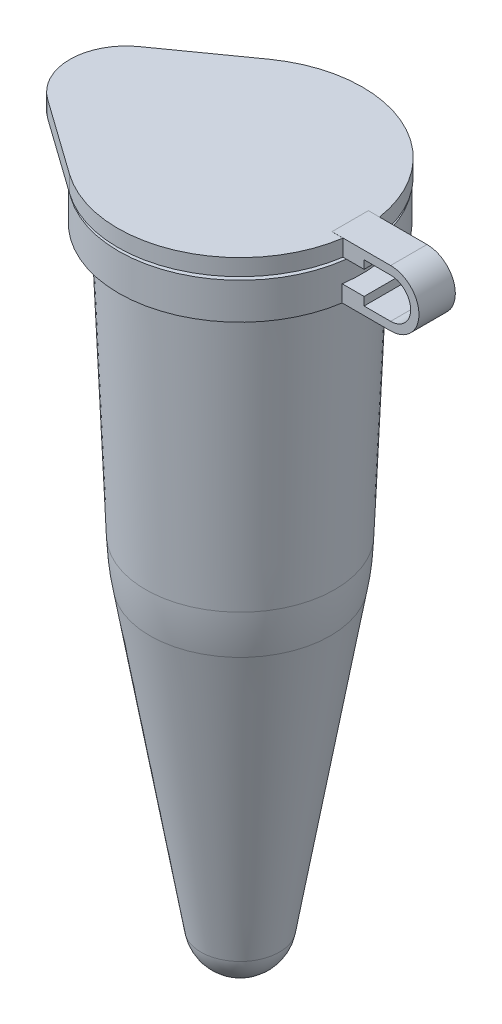
ISO-10303-21;
HEADER;
FILE_DESCRIPTION(('STEP AP214'),'2;1');
FILE_NAME('part.step','',(''),(''),'','','');
FILE_SCHEMA(('AUTOMOTIVE_DESIGN { 1 0 10303 214 1 1 1 1 }'));
ENDSEC;
DATA;
#1=APPLICATION_CONTEXT('core data for automotive mechanical design processes');
#2=APPLICATION_PROTOCOL_DEFINITION('international standard','automotive_design',2000,#1);
#3=PRODUCT_CONTEXT('',#1,'mechanical');
#4=PRODUCT('Part','Part','',(#3));
#5=PRODUCT_RELATED_PRODUCT_CATEGORY('part','',(#4));
#6=PRODUCT_DEFINITION_FORMATION('','',#4);
#7=PRODUCT_DEFINITION_CONTEXT('part definition',#1,'design');
#8=PRODUCT_DEFINITION('design','',#6,#7);
#9=PRODUCT_DEFINITION_SHAPE('','',#8);
#10=(LENGTH_UNIT() NAMED_UNIT(*) SI_UNIT(.MILLI.,.METRE.));
#11=(NAMED_UNIT(*) PLANE_ANGLE_UNIT() SI_UNIT($,.RADIAN.));
#12=(NAMED_UNIT(*) SI_UNIT($,.STERADIAN.) SOLID_ANGLE_UNIT());
#13=UNCERTAINTY_MEASURE_WITH_UNIT(LENGTH_MEASURE(1.E-05),#10,'distance_accuracy_value','');
#14=(GEOMETRIC_REPRESENTATION_CONTEXT(3) GLOBAL_UNCERTAINTY_ASSIGNED_CONTEXT((#13)) GLOBAL_UNIT_ASSIGNED_CONTEXT((#10,
#11,#12)) REPRESENTATION_CONTEXT('',''));
#15=CARTESIAN_POINT('',(0.,0.,0.));
#16=DIRECTION('',(0.,0.,1.));
#17=DIRECTION('',(1.,0.,0.));
#18=AXIS2_PLACEMENT_3D('',#15,#16,#17);
#19=CARTESIAN_POINT('',(3.37929453171218,0.112660744795347,0.5588));
#20=DIRECTION('',(0.,1.,0.));
#21=DIRECTION('',(0.,0.,1.));
#22=AXIS2_PLACEMENT_3D('',#19,#20,#21);
#23=PLANE('',#22);
#24=DIRECTION('',(1.,0.,0.));
#25=VECTOR('',#24,1.);
#26=CARTESIAN_POINT('',(3.37929453171218,0.112660744795347,0.5588));
#27=LINE('',#26,#25);
#28=CARTESIAN_POINT('',(3.71743556769986,0.112660744795347,0.5588));
#29=VERTEX_POINT('',#28);
#30=CARTESIAN_POINT('',(4.36532286100338,0.112660744795347,0.5588));
#31=VERTEX_POINT('',#30);
#32=EDGE_CURVE('E225',#29,#31,#27,.T.);
#33=ORIENTED_EDGE('',*,*,#32,.F.);
#34=CARTESIAN_POINT('',(0.,0.112660744795347,0.));
#35=DIRECTION('',(0.,-1.,0.));
#36=DIRECTION('',(0.,0.,-1.));
#37=AXIS2_PLACEMENT_3D('',#34,#35,#36);
#38=CIRCLE('',#37,3.7592);
#39=CARTESIAN_POINT('',(-2.17993527229624,0.112660744795347,3.06259152493419));
#40=VERTEX_POINT('',#39);
#41=EDGE_CURVE('E198',#29,#40,#38,.T.);
#42=ORIENTED_EDGE('',*,*,#41,.T.);
#43=DIRECTION('',(-0.814692361389175,0.,-0.579893400802363));
#44=VECTOR('',#43,1.);
#45=CARTESIAN_POINT('',(-2.17993527229624,0.112660744795347,3.06259152493419));
#46=LINE('',#45,#44);
#47=CARTESIAN_POINT('',(-4.50743423035828,0.112660744795347,1.40589097130054));
#48=VERTEX_POINT('',#47);
#49=EDGE_CURVE('E181',#40,#48,#46,.T.);
#50=ORIENTED_EDGE('',*,*,#49,.T.);
#51=CARTESIAN_POINT('',(-3.50672901309731,0.112660744795347,0.));
#52=DIRECTION('',(0.,-1.,0.));
#53=DIRECTION('',(0.,0.,-1.));
#54=AXIS2_PLACEMENT_3D('',#51,#52,#53);
#55=CIRCLE('',#54,1.72567098690269);
#56=CARTESIAN_POINT('',(-4.50743423035828,0.112660744795347,-1.40589097130054));
#57=VERTEX_POINT('',#56);
#58=EDGE_CURVE('E200',#48,#57,#55,.T.);
#59=ORIENTED_EDGE('',*,*,#58,.T.);
#60=DIRECTION('',(0.814692361389175,0.,-0.579893400802363));
#61=VECTOR('',#60,1.);
#62=CARTESIAN_POINT('',(-2.17993527229624,0.112660744795347,-3.06259152493419));
#63=LINE('',#62,#61);
#64=CARTESIAN_POINT('',(-2.17993527229624,0.112660744795347,-3.06259152493419));
#65=VERTEX_POINT('',#64);
#66=EDGE_CURVE('E174',#57,#65,#63,.T.);
#67=ORIENTED_EDGE('',*,*,#66,.T.);
#68=CARTESIAN_POINT('',(3.71743556769986,0.112660744795347,-0.5588));
#69=VERTEX_POINT('',#68);
#70=EDGE_CURVE('E52',#65,#69,#38,.T.);
#71=ORIENTED_EDGE('',*,*,#70,.T.);
#72=DIRECTION('',(1.,0.,0.));
#73=VECTOR('',#72,1.);
#74=CARTESIAN_POINT('',(3.37929453171218,0.112660744795347,-0.5588));
#75=LINE('',#74,#73);
#76=CARTESIAN_POINT('',(4.36532286100338,0.112660744795347,-0.5588));
#77=VERTEX_POINT('',#76);
#78=EDGE_CURVE('E250',#69,#77,#75,.T.);
#79=ORIENTED_EDGE('',*,*,#78,.T.);
#80=DIRECTION('',(0.,0.,-1.));
#81=VECTOR('',#80,1.);
#82=CARTESIAN_POINT('',(4.36532286100338,0.112660744795347,0.5588));
#83=LINE('',#82,#81);
#84=EDGE_CURVE('E278',#31,#77,#83,.T.);
#85=ORIENTED_EDGE('',*,*,#84,.F.);
#86=EDGE_LOOP('',(#33,#42,#50,#59,#67,#71,#79,#85));
#87=FACE_BOUND('',#86,.T.);
#88=CARTESIAN_POINT('',(0.,0.112660744795347,0.));
#89=DIRECTION('',(0.,1.,0.));
#90=DIRECTION('',(0.,0.,1.));
#91=AXIS2_PLACEMENT_3D('',#88,#89,#90);
#92=CIRCLE('',#91,2.61504629300573);
#93=CARTESIAN_POINT('',(0.,0.112660744795347,2.61504629300573));
#94=VERTEX_POINT('',#93);
#95=EDGE_CURVE('E11',#94,#94,#92,.F.);
#96=ORIENTED_EDGE('',*,*,#95,.F.);
#97=EDGE_LOOP('',(#96));
#98=FACE_BOUND('',#97,.T.);
#99=ADVANCED_FACE('F37',(#87,#98),#23,.F.);
#100=CARTESIAN_POINT('',(3.37929453171218,0.622812555298089,0.5588));
#101=DIRECTION('',(1.,0.,0.));
#102=DIRECTION('',(0.,0.,-1.));
#103=AXIS2_PLACEMENT_3D('',#100,#101,#102);
#104=PLANE('',#103);
#105=DIRECTION('',(0.,0.,-1.));
#106=VECTOR('',#105,1.);
#107=CARTESIAN_POINT('',(3.37929453171218,0.620660744795347,0.5588));
#108=LINE('',#107,#106);
#109=CARTESIAN_POINT('',(3.37929453171218,0.620660744795347,0.5588));
#110=VERTEX_POINT('',#109);
#111=CARTESIAN_POINT('',(3.37929453171218,0.620660744795347,-0.5588));
#112=VERTEX_POINT('',#111);
#113=EDGE_CURVE('E206',#110,#112,#108,.T.);
#114=ORIENTED_EDGE('',*,*,#113,.F.);
#115=DIRECTION('',(0.,-1.,0.));
#116=VECTOR('',#115,1.);
#117=CARTESIAN_POINT('',(3.37929453171218,0.622812555298089,0.5588));
#118=LINE('',#117,#116);
#119=CARTESIAN_POINT('',(3.37929453171218,0.622812555298089,0.5588));
#120=VERTEX_POINT('',#119);
#121=EDGE_CURVE('E222',#120,#110,#118,.T.);
#122=ORIENTED_EDGE('',*,*,#121,.F.);
#123=DIRECTION('',(0.,0.,-1.));
#124=VECTOR('',#123,1.);
#125=CARTESIAN_POINT('',(3.37929453171218,0.622812555298089,0.5588));
#126=LINE('',#125,#124);
#127=CARTESIAN_POINT('',(3.37929453171218,0.622812555298089,-0.5588));
#128=VERTEX_POINT('',#127);
#129=EDGE_CURVE('E281',#120,#128,#126,.T.);
#130=ORIENTED_EDGE('',*,*,#129,.T.);
#131=DIRECTION('',(0.,-1.,0.));
#132=VECTOR('',#131,1.);
#133=CARTESIAN_POINT('',(3.37929453171218,0.622812555298089,-0.5588));
#134=LINE('',#133,#132);
#135=EDGE_CURVE('E247',#128,#112,#134,.T.);
#136=ORIENTED_EDGE('',*,*,#135,.T.);
#137=EDGE_LOOP('',(#114,#122,#130,#136));
#138=FACE_BOUND('',#137,.T.);
#139=ADVANCED_FACE('F382',(#138),#104,.F.);
#140=CARTESIAN_POINT('',(0.,-1.1176,0.));
#141=DIRECTION('',(0.,1.,0.));
#142=DIRECTION('',(0.,0.,1.));
#143=AXIS2_PLACEMENT_3D('',#140,#141,#142);
#144=CYLINDRICAL_SURFACE('',#143,3.7338);
#145=CARTESIAN_POINT('',(0.,0.,0.));
#146=DIRECTION('',(0.,1.,0.));
#147=DIRECTION('',(0.,0.,1.));
#148=AXIS2_PLACEMENT_3D('',#145,#146,#147);
#149=CIRCLE('',#148,3.7338);
#150=CARTESIAN_POINT('',(0.,0.,3.7338));
#151=VERTEX_POINT('',#150);
#152=EDGE_CURVE('E322',#151,#151,#149,.T.);
#153=ORIENTED_EDGE('',*,*,#152,.F.);
#154=EDGE_LOOP('',(#153));
#155=FACE_BOUND('',#154,.T.);
#156=CARTESIAN_POINT('',(0.,-1.1176,0.));
#157=DIRECTION('',(0.,1.,0.));
#158=DIRECTION('',(0.,0.,1.));
#159=AXIS2_PLACEMENT_3D('',#156,#157,#158);
#160=CIRCLE('',#159,3.7338);
#161=CARTESIAN_POINT('',(3.69174823085216,-1.1176,-0.5588));
#162=VERTEX_POINT('',#161);
#163=CARTESIAN_POINT('',(3.69174823085216,-1.1176,0.5588));
#164=VERTEX_POINT('',#163);
#165=EDGE_CURVE('E325',#162,#164,#160,.T.);
#166=ORIENTED_EDGE('',*,*,#165,.T.);
#167=DIRECTION('',(0.,1.,0.));
#168=VECTOR('',#167,1.);
#169=CARTESIAN_POINT('',(3.69174823085216,-1.1176,0.5588));
#170=LINE('',#169,#168);
#171=CARTESIAN_POINT('',(3.69174823085216,-0.607448189497257,0.5588));
#172=VERTEX_POINT('',#171);
#173=EDGE_CURVE('E60',#164,#172,#170,.T.);
#174=ORIENTED_EDGE('',*,*,#173,.T.);
#175=CARTESIAN_POINT('',(0.,-0.607448189497257,0.));
#176=DIRECTION('',(0.,-1.,0.));
#177=DIRECTION('',(0.,0.,-1.));
#178=AXIS2_PLACEMENT_3D('',#175,#176,#177);
#179=CIRCLE('',#178,3.7338);
#180=CARTESIAN_POINT('',(3.69174823085216,-0.607448189497257,-0.5588));
#181=VERTEX_POINT('',#180);
#182=EDGE_CURVE('E327',#172,#181,#179,.F.);
#183=ORIENTED_EDGE('',*,*,#182,.T.);
#184=DIRECTION('',(0.,1.,0.));
#185=VECTOR('',#184,1.);
#186=CARTESIAN_POINT('',(3.69174823085216,-1.1176,-0.5588));
#187=LINE('',#186,#185);
#188=EDGE_CURVE('E290',#162,#181,#187,.T.);
#189=ORIENTED_EDGE('',*,*,#188,.F.);
#190=EDGE_LOOP('',(#166,#174,#183,#189));
#191=FACE_BOUND('',#190,.T.);
#192=ADVANCED_FACE('F39',(#155,#191),#144,.T.);
#193=CARTESIAN_POINT('',(0.,-1.1176,0.));
#194=DIRECTION('',(0.,1.,0.));
#195=DIRECTION('',(0.,0.,1.));
#196=AXIS2_PLACEMENT_3D('',#193,#194,#195);
#197=PLANE('',#196);
#198=ORIENTED_EDGE('',*,*,#165,.F.);
#199=DIRECTION('',(1.,0.,0.));
#200=VECTOR('',#199,1.);
#201=CARTESIAN_POINT('',(4.36532286100338,-1.1176,-0.5588));
#202=LINE('',#201,#200);
#203=CARTESIAN_POINT('',(5.18003568051449,-1.1176,-0.5588));
#204=VERTEX_POINT('',#203);
#205=EDGE_CURVE('E214',#162,#204,#202,.T.);
#206=ORIENTED_EDGE('',*,*,#205,.T.);
#207=DIRECTION('',(0.,0.,-1.));
#208=VECTOR('',#207,1.);
#209=CARTESIAN_POINT('',(5.18003568051449,-1.1176,0.5588));
#210=LINE('',#209,#208);
#211=CARTESIAN_POINT('',(5.18003568051449,-1.1176,0.5588));
#212=VERTEX_POINT('',#211);
#213=EDGE_CURVE('E287',#212,#204,#210,.T.);
#214=ORIENTED_EDGE('',*,*,#213,.F.);
#215=DIRECTION('',(1.,0.,0.));
#216=VECTOR('',#215,1.);
#217=CARTESIAN_POINT('',(3.37929453171218,-1.1176,0.5588));
#218=LINE('',#217,#216);
#219=EDGE_CURVE('E215',#164,#212,#218,.T.);
#220=ORIENTED_EDGE('',*,*,#219,.F.);
#221=EDGE_LOOP('',(#198,#206,#214,#220));
#222=FACE_BOUND('',#221,.T.);
#223=CARTESIAN_POINT('',(0.,-1.1176,0.));
#224=DIRECTION('',(0.,1.,0.));
#225=DIRECTION('',(-1.,0.,0.));
#226=AXIS2_PLACEMENT_3D('',#223,#224,#225);
#227=CIRCLE('',#226,3.2385);
#228=CARTESIAN_POINT('',(-3.2385,-1.1176,0.));
#229=VERTEX_POINT('',#228);
#230=EDGE_CURVE('E315',#229,#229,#227,.T.);
#231=ORIENTED_EDGE('',*,*,#230,.T.);
#232=EDGE_LOOP('',(#231));
#233=FACE_BOUND('',#232,.T.);
#234=ADVANCED_FACE('F440',(#222,#233),#197,.F.);
#235=CARTESIAN_POINT('',(0.,0.,0.));
#236=DIRECTION('',(0.,1.,0.));
#237=DIRECTION('',(0.,0.,1.));
#238=AXIS2_PLACEMENT_3D('',#235,#236,#237);
#239=PLANE('',#238);
#240=CARTESIAN_POINT('',(0.,0.,0.));
#241=DIRECTION('',(0.,1.,0.));
#242=DIRECTION('',(0.,0.,1.));
#243=AXIS2_PLACEMENT_3D('',#240,#241,#242);
#244=CIRCLE('',#243,2.6797);
#245=CARTESIAN_POINT('',(0.,0.,2.6797));
#246=VERTEX_POINT('',#245);
#247=EDGE_CURVE('E318',#246,#246,#244,.T.);
#248=ORIENTED_EDGE('',*,*,#247,.F.);
#249=EDGE_LOOP('',(#248));
#250=FACE_BOUND('',#249,.T.);
#251=ORIENTED_EDGE('',*,*,#152,.T.);
#252=EDGE_LOOP('',(#251));
#253=FACE_BOUND('',#252,.T.);
#254=ADVANCED_FACE('F438',(#250,#253),#239,.T.);
#255=CARTESIAN_POINT('',(0.,-1.1176,0.));
#256=DIRECTION('',(0.,1.,0.));
#257=DIRECTION('',(0.,0.,1.));
#258=AXIS2_PLACEMENT_3D('',#255,#256,#257);
#259=CYLINDRICAL_SURFACE('',#258,2.6797);
#260=CARTESIAN_POINT('',(0.,-1.1176,0.));
#261=DIRECTION('',(0.,1.,0.));
#262=DIRECTION('',(0.,0.,1.));
#263=AXIS2_PLACEMENT_3D('',#260,#261,#262);
#264=CIRCLE('',#263,2.6797);
#265=CARTESIAN_POINT('',(0.,-1.1176,2.6797));
#266=VERTEX_POINT('',#265);
#267=EDGE_CURVE('E319',#266,#266,#264,.T.);
#268=ORIENTED_EDGE('',*,*,#267,.F.);
#269=EDGE_LOOP('',(#268));
#270=FACE_BOUND('',#269,.T.);
#271=ORIENTED_EDGE('',*,*,#247,.T.);
#272=EDGE_LOOP('',(#271));
#273=FACE_BOUND('',#272,.T.);
#274=ADVANCED_FACE('F416',(#270,#273),#259,.F.);
#275=CARTESIAN_POINT('',(0.,-10.6189522829648,0.));
#276=DIRECTION('',(0.,1.,0.));
#277=DIRECTION('',(-1.,0.,0.));
#278=AXIS2_PLACEMENT_3D('',#275,#276,#277);
#279=CONICAL_SURFACE('',#278,2.20736268825908,0.168485193383243);
#280=CARTESIAN_POINT('',(0.,-19.8151435012409,0.));
#281=DIRECTION('',(0.,1.,0.));
#282=DIRECTION('',(-1.,0.,0.));
#283=AXIS2_PLACEMENT_3D('',#280,#281,#282);
#284=CIRCLE('',#283,0.643110937451484);
#285=CARTESIAN_POINT('',(-0.643110937451482,-19.8151435012409,0.));
#286=VERTEX_POINT('',#285);
#287=EDGE_CURVE('E294',#286,#286,#284,.T.);
#288=CARTESIAN_POINT('',(0.,-10.6189522829648,0.));
#289=DIRECTION('',(0.,1.,0.));
#290=DIRECTION('',(-1.,0.,0.));
#291=AXIS2_PLACEMENT_3D('',#288,#289,#290);
#292=CIRCLE('',#291,2.20736268825908);
#293=CARTESIAN_POINT('',(-2.20736268825908,-10.6189522829648,0.));
#294=VERTEX_POINT('',#293);
#295=EDGE_CURVE('E297',#294,#294,#292,.T.);
#296=CARTESIAN_POINT('',(-0.643110937451482,-19.8151435012409,0.));
#297=CARTESIAN_POINT('',(-0.659405226522394,-19.7193498427172,0.));
#298=CARTESIAN_POINT('',(-0.675699515593307,-19.6235561841935,0.));
#299=CARTESIAN_POINT('',(-0.708288093735131,-19.431968867146,0.));
#300=CARTESIAN_POINT('',(-0.724582382806044,-19.3361752086223,0.));
#301=CARTESIAN_POINT('',(-0.757170960947869,-19.1445878915749,0.));
#302=CARTESIAN_POINT('',(-0.773465250018782,-19.0487942330512,0.));
#303=CARTESIAN_POINT('',(-0.806053828160606,-18.8572069160038,0.));
#304=CARTESIAN_POINT('',(-0.822348117231518,-18.7614132574801,0.));
#305=CARTESIAN_POINT('',(-0.854936695373343,-18.5698259404327,0.));
#306=CARTESIAN_POINT('',(-0.871230984444256,-18.474032281909,0.));
#307=CARTESIAN_POINT('',(-0.903819562586081,-18.2824449648615,0.));
#308=CARTESIAN_POINT('',(-0.920113851656993,-18.1866513063378,0.));
#309=CARTESIAN_POINT('',(-0.952702429798818,-17.9950639892904,0.));
#310=CARTESIAN_POINT('',(-0.968996718869731,-17.8992703307667,0.));
#311=CARTESIAN_POINT('',(-1.00158529701156,-17.7076830137193,0.));
#312=CARTESIAN_POINT('',(-1.01787958608247,-17.6118893551956,0.));
#313=CARTESIAN_POINT('',(-1.05046816422429,-17.4203020381482,0.));
#314=CARTESIAN_POINT('',(-1.06676245329521,-17.3245083796244,0.));
#315=CARTESIAN_POINT('',(-1.09935103143703,-17.132921062577,0.));
#316=CARTESIAN_POINT('',(-1.11564532050794,-17.0371274040533,0.));
#317=CARTESIAN_POINT('',(-1.14823389864977,-16.8455400870059,0.));
#318=CARTESIAN_POINT('',(-1.16452818772068,-16.7497464284822,0.));
#319=CARTESIAN_POINT('',(-1.19711676586251,-16.5581591114348,0.));
#320=CARTESIAN_POINT('',(-1.21341105493342,-16.4623654529111,0.));
#321=CARTESIAN_POINT('',(-1.24599963307524,-16.2707781358637,0.));
#322=CARTESIAN_POINT('',(-1.26229392214615,-16.1749844773399,0.));
#323=CARTESIAN_POINT('',(-1.29488250028798,-15.9833971602925,0.));
#324=CARTESIAN_POINT('',(-1.31117678935889,-15.8876035017688,0.));
#325=CARTESIAN_POINT('',(-1.34376536750072,-15.6960161847214,0.));
#326=CARTESIAN_POINT('',(-1.36005965657163,-15.6002225261977,0.));
#327=CARTESIAN_POINT('',(-1.39264823471345,-15.4086352091503,0.));
#328=CARTESIAN_POINT('',(-1.40894252378437,-15.3128415506266,0.));
#329=CARTESIAN_POINT('',(-1.44153110192619,-15.1212542335791,0.));
#330=CARTESIAN_POINT('',(-1.4578253909971,-15.0254605750554,0.));
#331=CARTESIAN_POINT('',(-1.49041396913893,-14.833873258008,0.));
#332=CARTESIAN_POINT('',(-1.50670825820984,-14.7380795994843,0.));
#333=CARTESIAN_POINT('',(-1.53929683635167,-14.5464922824369,0.));
#334=CARTESIAN_POINT('',(-1.55559112542258,-14.4506986239132,0.));
#335=CARTESIAN_POINT('',(-1.5881797035644,-14.2591113068658,0.));
#336=CARTESIAN_POINT('',(-1.60447399263532,-14.1633176483421,0.));
#337=CARTESIAN_POINT('',(-1.63706257077714,-13.9717303312946,0.));
#338=CARTESIAN_POINT('',(-1.65335685984805,-13.8759366727709,0.));
#339=CARTESIAN_POINT('',(-1.68594543798988,-13.6843493557235,0.));
#340=CARTESIAN_POINT('',(-1.70223972706079,-13.5885556971998,0.));
#341=CARTESIAN_POINT('',(-1.73482830520262,-13.3969683801524,0.));
#342=CARTESIAN_POINT('',(-1.75112259427353,-13.3011747216287,0.));
#343=CARTESIAN_POINT('',(-1.78371117241535,-13.1095874045813,0.));
#344=CARTESIAN_POINT('',(-1.80000546148627,-13.0137937460575,0.));
#345=CARTESIAN_POINT('',(-1.83259403962809,-12.8222064290101,0.));
#346=CARTESIAN_POINT('',(-1.848888328699,-12.7264127704864,0.));
#347=CARTESIAN_POINT('',(-1.88147690684083,-12.534825453439,0.));
#348=CARTESIAN_POINT('',(-1.89777119591174,-12.4390317949153,0.));
#349=CARTESIAN_POINT('',(-1.93035977405357,-12.2474444778679,0.));
#350=CARTESIAN_POINT('',(-1.94665406312448,-12.1516508193442,0.));
#351=CARTESIAN_POINT('',(-1.9792426412663,-11.9600635022968,0.));
#352=CARTESIAN_POINT('',(-1.99553693033721,-11.864269843773,0.));
#353=CARTESIAN_POINT('',(-2.02812550847904,-11.6726825267256,0.));
#354=CARTESIAN_POINT('',(-2.04441979754995,-11.5768888682019,0.));
#355=CARTESIAN_POINT('',(-2.07700837569178,-11.3853015511545,0.));
#356=CARTESIAN_POINT('',(-2.09330266476269,-11.2895078926308,0.));
#357=CARTESIAN_POINT('',(-2.12589124290451,-11.0979205755834,0.));
#358=CARTESIAN_POINT('',(-2.14218553197543,-11.0021269170597,0.));
#359=CARTESIAN_POINT('',(-2.17477411011725,-10.8105396000122,0.));
#360=CARTESIAN_POINT('',(-2.19106839918816,-10.7147459414885,0.));
#361=CARTESIAN_POINT('',(-2.20736268825908,-10.6189522829648,0.));
#362=B_SPLINE_CURVE_WITH_KNOTS('',3,(#296,#297,#298,#299,#300,#301,#302,#303,#304,#305,#306,
#307,#308,#309,#310,#311,#312,#313,#314,#315,#316,#317,#318,#319,#320,#321,#322,#323,#324,#325,
#326,#327,#328,#329,#330,#331,#332,#333,#334,#335,#336,#337,#338,#339,#340,#341,#342,#343,#344,
#345,#346,#347,#348,#349,#350,#351,#352,#353,#354,#355,#356,#357,#358,#359,#360,#361),
.UNSPECIFIED.,.F.,.F.,(4,2,2,2,2,2,2,2,2,2,2,2,2,2,2,2,2,2,2,2,2,2,2,2,2,2,2,2,2,2,2,2,4),(0.,
0.291508764580328,0.58301752916066,0.874526293740988,1.16603505832132,1.45754382290165,
1.74905258748198,2.04056135206231,2.33207011664264,2.62357888122297,2.9150876458033,
3.20659641038363,3.49810517496396,3.78961393954429,4.08112270412462,4.37263146870495,
4.66414023328528,4.95564899786562,5.24715776244595,5.53866652702628,5.83017529160661,
6.12168405618694,6.41319282076727,6.7047015853476,6.99621034992793,7.28771911450826,
7.57922787908859,7.87073664366892,8.16224540824925,8.45375417282958,8.74526293740991,
9.03677170199024,9.32828046657057),.UNSPECIFIED.);
#363=EDGE_CURVE('BSEAM412',#286,#294,#362,.T.);
#364=ORIENTED_EDGE('',*,*,#287,.F.);
#365=ORIENTED_EDGE('',*,*,#295,.T.);
#366=ORIENTED_EDGE('',*,*,#363,.T.);
#367=ORIENTED_EDGE('',*,*,#363,.F.);
#368=EDGE_LOOP('',(#364,#366,#365,#367));
#369=FACE_BOUND('',#368,.T.);
#370=ADVANCED_FACE('F412',(#369),#279,.F.);
#371=CARTESIAN_POINT('',(0.,-9.0110645306219,0.));
#372=DIRECTION('',(0.,1.,0.));
#373=DIRECTION('',(-1.,0.,0.));
#374=AXIS2_PLACEMENT_3D('',#371,#372,#373);
#375=DEGENERATE_TOROIDAL_SURFACE('',#374,7.24536333262324,9.5885,.F.);
#376=ORIENTED_EDGE('',*,*,#295,.F.);
#377=EDGE_LOOP('',(#376));
#378=FACE_BOUND('',#377,.T.);
#379=CARTESIAN_POINT('',(0.,-9.39429806633005,0.));
#380=DIRECTION('',(0.,1.,0.));
#381=DIRECTION('',(-1.,0.,0.));
#382=AXIS2_PLACEMENT_3D('',#379,#380,#381);
#383=CIRCLE('',#382,2.33547506008064);
#384=CARTESIAN_POINT('',(-2.33547506008064,-9.39429806633005,0.));
#385=VERTEX_POINT('',#384);
#386=EDGE_CURVE('E300',#385,#385,#383,.T.);
#387=ORIENTED_EDGE('',*,*,#386,.T.);
#388=EDGE_LOOP('',(#387));
#389=FACE_BOUND('',#388,.T.);
#390=ADVANCED_FACE('F408',(#378,#389),#375,.T.);
#391=CARTESIAN_POINT('',(0.,-1.09475826608362,0.));
#392=DIRECTION('',(0.,1.,0.));
#393=DIRECTION('',(-1.,0.,0.));
#394=AXIS2_PLACEMENT_3D('',#391,#392,#393);
#395=CONICAL_SURFACE('',#394,2.6674566520905,0.0399786871232904);
#396=ORIENTED_EDGE('',*,*,#386,.F.);
#397=EDGE_LOOP('',(#396));
#398=FACE_BOUND('',#397,.T.);
#399=CARTESIAN_POINT('',(0.,-1.1176,0.));
#400=DIRECTION('',(0.,1.,0.));
#401=DIRECTION('',(-1.,0.,0.));
#402=AXIS2_PLACEMENT_3D('',#399,#400,#401);
#403=CIRCLE('',#402,2.66654298273384);
#404=CARTESIAN_POINT('',(-2.66654298273384,-1.1176,0.));
#405=VERTEX_POINT('',#404);
#406=EDGE_CURVE('E303',#405,#405,#403,.T.);
#407=ORIENTED_EDGE('',*,*,#406,.T.);
#408=EDGE_LOOP('',(#407));
#409=FACE_BOUND('',#408,.T.);
#410=ADVANCED_FACE('F404',(#398,#409),#395,.F.);
#411=CARTESIAN_POINT('',(0.,-19.7057517556807,0.));
#412=DIRECTION('',(0.,1.,0.));
#413=DIRECTION('',(-1.,0.,0.));
#414=AXIS2_PLACEMENT_3D('',#411,#412,#413);
#415=SPHERICAL_SURFACE('',#414,0.652348244319259);
#416=ORIENTED_EDGE('',*,*,#287,.T.);
#417=EDGE_LOOP('',(#416));
#418=FACE_BOUND('',#417,.T.);
#419=ADVANCED_FACE('F400',(#418),#415,.F.);
#420=CARTESIAN_POINT('',(-3.2385,-1.1176,0.));
#421=DIRECTION('',(0.,1.,0.));
#422=DIRECTION('',(-1.,0.,0.));
#423=AXIS2_PLACEMENT_3D('',#420,#421,#422);
#424=PLANE('',#423);
#425=ORIENTED_EDGE('',*,*,#406,.F.);
#426=EDGE_LOOP('',(#425));
#427=FACE_BOUND('',#426,.T.);
#428=ORIENTED_EDGE('',*,*,#267,.T.);
#429=EDGE_LOOP('',(#428));
#430=FACE_BOUND('',#429,.T.);
#431=ADVANCED_FACE('F403',(#427,#430),#424,.T.);
#432=CARTESIAN_POINT('',(0.,-19.7057517556807,0.));
#433=DIRECTION('',(0.,1.,0.));
#434=DIRECTION('',(-1.,0.,0.));
#435=AXIS2_PLACEMENT_3D('',#432,#433,#434);
#436=SPHERICAL_SURFACE('',#435,1.22384824431926);
#437=CARTESIAN_POINT('',(0.,-19.9109778705858,0.));
#438=DIRECTION('',(0.,1.,0.));
#439=DIRECTION('',(-1.,0.,0.));
#440=AXIS2_PLACEMENT_3D('',#437,#438,#439);
#441=CIRCLE('',#440,1.2065184486299);
#442=CARTESIAN_POINT('',(-1.2065184486299,-19.9109778705858,0.));
#443=VERTEX_POINT('',#442);
#444=EDGE_CURVE('E306',#443,#443,#441,.T.);
#445=ORIENTED_EDGE('',*,*,#444,.F.);
#446=EDGE_LOOP('',(#445));
#447=FACE_BOUND('',#446,.T.);
#448=ADVANCED_FACE('F428',(#447),#436,.T.);
#449=CARTESIAN_POINT('',(0.,-1.1176,0.));
#450=DIRECTION('',(0.,1.,0.));
#451=DIRECTION('',(-1.,0.,0.));
#452=AXIS2_PLACEMENT_3D('',#449,#450,#451);
#453=CONICAL_SURFACE('',#452,3.2385,0.0399786871232904);
#454=CARTESIAN_POINT('',(0.,-9.41713980024643,0.));
#455=DIRECTION('',(0.,1.,0.));
#456=DIRECTION('',(-1.,0.,0.));
#457=AXIS2_PLACEMENT_3D('',#454,#455,#456);
#458=CIRCLE('',#457,2.90651840799014);
#459=CARTESIAN_POINT('',(-2.90651840799014,-9.41713980024643,0.));
#460=VERTEX_POINT('',#459);
#461=EDGE_CURVE('E312',#460,#460,#458,.T.);
#462=ORIENTED_EDGE('',*,*,#461,.T.);
#463=EDGE_LOOP('',(#462));
#464=FACE_BOUND('',#463,.T.);
#465=ORIENTED_EDGE('',*,*,#230,.F.);
#466=EDGE_LOOP('',(#465));
#467=FACE_BOUND('',#466,.T.);
#468=ADVANCED_FACE('F424',(#464,#467),#453,.T.);
#469=CARTESIAN_POINT('',(0.,-9.0110645306219,0.));
#470=DIRECTION('',(0.,1.,0.));
#471=DIRECTION('',(-1.,0.,0.));
#472=AXIS2_PLACEMENT_3D('',#469,#470,#471);
#473=DEGENERATE_TOROIDAL_SURFACE('',#472,7.24536333262324,10.16,.F.);
#474=CARTESIAN_POINT('',(0.,-10.7147866523098,0.));
#475=DIRECTION('',(0.,1.,0.));
#476=DIRECTION('',(-1.,0.,0.));
#477=AXIS2_PLACEMENT_3D('',#474,#475,#476);
#478=CIRCLE('',#477,2.77077019943749);
#479=CARTESIAN_POINT('',(-2.77077019943749,-10.7147866523098,0.));
#480=VERTEX_POINT('',#479);
#481=EDGE_CURVE('E309',#480,#480,#478,.T.);
#482=ORIENTED_EDGE('',*,*,#481,.T.);
#483=EDGE_LOOP('',(#482));
#484=FACE_BOUND('',#483,.T.);
#485=ORIENTED_EDGE('',*,*,#461,.F.);
#486=EDGE_LOOP('',(#485));
#487=FACE_BOUND('',#486,.T.);
#488=ADVANCED_FACE('F420',(#484,#487),#473,.F.);
#489=CARTESIAN_POINT('',(0.,-10.7147866523098,0.));
#490=DIRECTION('',(0.,1.,0.));
#491=DIRECTION('',(-1.,0.,0.));
#492=AXIS2_PLACEMENT_3D('',#489,#490,#491);
#493=CONICAL_SURFACE('',#492,2.77077019943749,0.168485193383243);
#494=ORIENTED_EDGE('',*,*,#444,.T.);
#495=EDGE_LOOP('',(#494));
#496=FACE_BOUND('',#495,.T.);
#497=ORIENTED_EDGE('',*,*,#481,.F.);
#498=EDGE_LOOP('',(#497));
#499=FACE_BOUND('',#498,.T.);
#500=ADVANCED_FACE('F398',(#496,#499),#493,.T.);
#501=CARTESIAN_POINT('',(5.18003568051449,-0.247393722350955,0.5588));
#502=DIRECTION('',(0.,0.,-1.));
#503=DIRECTION('',(-1.,0.,0.));
#504=AXIS2_PLACEMENT_3D('',#501,#502,#503);
#505=CYLINDRICAL_SURFACE('',#504,0.870206277649045);
#506=CARTESIAN_POINT('',(5.18003568051449,-0.247393722350955,-0.5588));
#507=DIRECTION('',(0.,0.,1.));
#508=DIRECTION('',(-1.,0.,0.));
#509=AXIS2_PLACEMENT_3D('',#506,#507,#508);
#510=CIRCLE('',#509,0.870206277649045);
#511=CARTESIAN_POINT('',(5.18003568051449,0.62281255529809,-0.5588));
#512=VERTEX_POINT('',#511);
#513=EDGE_CURVE('E242',#204,#512,#510,.T.);
#514=ORIENTED_EDGE('',*,*,#513,.T.);
#515=DIRECTION('',(0.,0.,-1.));
#516=VECTOR('',#515,1.);
#517=CARTESIAN_POINT('',(5.18003568051449,0.62281255529809,0.5588));
#518=LINE('',#517,#516);
#519=CARTESIAN_POINT('',(5.18003568051449,0.62281255529809,0.5588));
#520=VERTEX_POINT('',#519);
#521=EDGE_CURVE('E284',#520,#512,#518,.T.);
#522=ORIENTED_EDGE('',*,*,#521,.F.);
#523=CARTESIAN_POINT('',(5.18003568051449,-0.247393722350955,0.5588));
#524=DIRECTION('',(0.,0.,1.));
#525=DIRECTION('',(-1.,0.,0.));
#526=AXIS2_PLACEMENT_3D('',#523,#524,#525);
#527=CIRCLE('',#526,0.870206277649045);
#528=EDGE_CURVE('E217',#212,#520,#527,.T.);
#529=ORIENTED_EDGE('',*,*,#528,.F.);
#530=ORIENTED_EDGE('',*,*,#213,.T.);
#531=EDGE_LOOP('',(#514,#522,#529,#530));
#532=FACE_BOUND('',#531,.T.);
#533=ADVANCED_FACE('F394',(#532),#505,.T.);
#534=CARTESIAN_POINT('',(4.36532286100338,0.622812555298089,0.5588));
#535=DIRECTION('',(0.,-1.,0.));
#536=DIRECTION('',(1.,0.,0.));
#537=AXIS2_PLACEMENT_3D('',#534,#535,#536);
#538=PLANE('',#537);
#539=DIRECTION('',(-1.,0.,0.));
#540=VECTOR('',#539,1.);
#541=CARTESIAN_POINT('',(4.36532286100338,0.622812555298089,-0.5588));
#542=LINE('',#541,#540);
#543=EDGE_CURVE('E245',#512,#128,#542,.T.);
#544=ORIENTED_EDGE('',*,*,#543,.T.);
#545=ORIENTED_EDGE('',*,*,#129,.F.);
#546=DIRECTION('',(-1.,0.,0.));
#547=VECTOR('',#546,1.);
#548=CARTESIAN_POINT('',(4.36532286100338,0.622812555298089,0.5588));
#549=LINE('',#548,#547);
#550=EDGE_CURVE('E220',#520,#120,#549,.T.);
#551=ORIENTED_EDGE('',*,*,#550,.F.);
#552=ORIENTED_EDGE('',*,*,#521,.T.);
#553=EDGE_LOOP('',(#544,#545,#551,#552));
#554=FACE_BOUND('',#553,.T.);
#555=ADVANCED_FACE('F391',(#554),#538,.F.);
#556=CARTESIAN_POINT('',(4.36532286100338,0.112660744795347,0.5588));
#557=DIRECTION('',(-1.,0.,0.));
#558=DIRECTION('',(0.,0.,1.));
#559=AXIS2_PLACEMENT_3D('',#556,#557,#558);
#560=PLANE('',#559);
#561=DIRECTION('',(0.,1.,0.));
#562=VECTOR('',#561,1.);
#563=CARTESIAN_POINT('',(4.36532286100338,0.112660744795347,-0.5588));
#564=LINE('',#563,#562);
#565=CARTESIAN_POINT('',(4.36532286100338,0.367736650046718,-0.5588));
#566=VERTEX_POINT('',#565);
#567=EDGE_CURVE('E252',#77,#566,#564,.T.);
#568=ORIENTED_EDGE('',*,*,#567,.T.);
#569=DIRECTION('',(0.,0.,-1.));
#570=VECTOR('',#569,1.);
#571=CARTESIAN_POINT('',(4.36532286100338,0.367736650046718,0.5588));
#572=LINE('',#571,#570);
#573=CARTESIAN_POINT('',(4.36532286100338,0.367736650046718,0.5588));
#574=VERTEX_POINT('',#573);
#575=EDGE_CURVE('E275',#574,#566,#572,.T.);
#576=ORIENTED_EDGE('',*,*,#575,.F.);
#577=DIRECTION('',(0.,1.,0.));
#578=VECTOR('',#577,1.);
#579=CARTESIAN_POINT('',(4.36532286100338,0.112660744795347,0.5588));
#580=LINE('',#579,#578);
#581=EDGE_CURVE('E227',#31,#574,#580,.T.);
#582=ORIENTED_EDGE('',*,*,#581,.F.);
#583=ORIENTED_EDGE('',*,*,#84,.T.);
#584=EDGE_LOOP('',(#568,#576,#582,#583));
#585=FACE_BOUND('',#584,.T.);
#586=ADVANCED_FACE('F347',(#585),#560,.F.);
#587=CARTESIAN_POINT('',(5.18003568051449,0.367736650046718,0.5588));
#588=DIRECTION('',(0.,1.,0.));
#589=DIRECTION('',(-1.,0.,0.));
#590=AXIS2_PLACEMENT_3D('',#587,#588,#589);
#591=PLANE('',#590);
#592=DIRECTION('',(1.,0.,0.));
#593=VECTOR('',#592,1.);
#594=CARTESIAN_POINT('',(5.18003568051449,0.367736650046718,-0.5588));
#595=LINE('',#594,#593);
#596=CARTESIAN_POINT('',(5.18003568051449,0.367736650046718,-0.5588));
#597=VERTEX_POINT('',#596);
#598=EDGE_CURVE('E254',#566,#597,#595,.T.);
#599=ORIENTED_EDGE('',*,*,#598,.T.);
#600=DIRECTION('',(0.,0.,-1.));
#601=VECTOR('',#600,1.);
#602=CARTESIAN_POINT('',(5.18003568051449,0.367736650046718,0.5588));
#603=LINE('',#602,#601);
#604=CARTESIAN_POINT('',(5.18003568051449,0.367736650046718,0.5588));
#605=VERTEX_POINT('',#604);
#606=EDGE_CURVE('E272',#605,#597,#603,.T.);
#607=ORIENTED_EDGE('',*,*,#606,.F.);
#608=DIRECTION('',(1.,0.,0.));
#609=VECTOR('',#608,1.);
#610=CARTESIAN_POINT('',(5.18003568051449,0.367736650046718,0.5588));
#611=LINE('',#610,#609);
#612=EDGE_CURVE('E229',#574,#605,#611,.T.);
#613=ORIENTED_EDGE('',*,*,#612,.F.);
#614=ORIENTED_EDGE('',*,*,#575,.T.);
#615=EDGE_LOOP('',(#599,#607,#613,#614));
#616=FACE_BOUND('',#615,.T.);
#617=ADVANCED_FACE('F485',(#616),#591,.F.);
#618=CARTESIAN_POINT('',(5.18003568051449,-0.247393722350955,0.5588));
#619=DIRECTION('',(0.,0.,-1.));
#620=DIRECTION('',(-1.,0.,0.));
#621=AXIS2_PLACEMENT_3D('',#618,#619,#620);
#622=CYLINDRICAL_SURFACE('',#621,0.615130372397673);
#623=CARTESIAN_POINT('',(5.18003568051449,-0.247393722350955,-0.5588));
#624=DIRECTION('',(0.,0.,-1.));
#625=DIRECTION('',(-1.,0.,0.));
#626=AXIS2_PLACEMENT_3D('',#623,#624,#625);
#627=CIRCLE('',#626,0.615130372397673);
#628=CARTESIAN_POINT('',(5.18003568051449,-0.862524094748629,-0.5588));
#629=VERTEX_POINT('',#628);
#630=EDGE_CURVE('E256',#597,#629,#627,.T.);
#631=ORIENTED_EDGE('',*,*,#630,.T.);
#632=DIRECTION('',(0.,0.,-1.));
#633=VECTOR('',#632,1.);
#634=CARTESIAN_POINT('',(5.18003568051449,-0.862524094748629,0.5588));
#635=LINE('',#634,#633);
#636=CARTESIAN_POINT('',(5.18003568051449,-0.862524094748629,0.5588));
#637=VERTEX_POINT('',#636);
#638=EDGE_CURVE('E269',#637,#629,#635,.T.);
#639=ORIENTED_EDGE('',*,*,#638,.F.);
#640=CARTESIAN_POINT('',(5.18003568051449,-0.247393722350955,0.5588));
#641=DIRECTION('',(0.,0.,-1.));
#642=DIRECTION('',(-1.,0.,0.));
#643=AXIS2_PLACEMENT_3D('',#640,#641,#642);
#644=CIRCLE('',#643,0.615130372397673);
#645=EDGE_CURVE('E231',#605,#637,#644,.T.);
#646=ORIENTED_EDGE('',*,*,#645,.F.);
#647=ORIENTED_EDGE('',*,*,#606,.T.);
#648=EDGE_LOOP('',(#631,#639,#646,#647));
#649=FACE_BOUND('',#648,.T.);
#650=ADVANCED_FACE('F483',(#649),#622,.F.);
#651=CARTESIAN_POINT('',(5.18003568051449,-0.862524094748629,0.5588));
#652=DIRECTION('',(0.,-1.,0.));
#653=DIRECTION('',(0.,0.,-1.));
#654=AXIS2_PLACEMENT_3D('',#651,#652,#653);
#655=PLANE('',#654);
#656=DIRECTION('',(-1.,0.,0.));
#657=VECTOR('',#656,1.);
#658=CARTESIAN_POINT('',(5.18003568051449,-0.862524094748629,-0.5588));
#659=LINE('',#658,#657);
#660=CARTESIAN_POINT('',(4.36532286100338,-0.862524094748629,-0.5588));
#661=VERTEX_POINT('',#660);
#662=EDGE_CURVE('E258',#629,#661,#659,.T.);
#663=ORIENTED_EDGE('',*,*,#662,.T.);
#664=DIRECTION('',(0.,0.,-1.));
#665=VECTOR('',#664,1.);
#666=CARTESIAN_POINT('',(4.36532286100338,-0.862524094748629,0.5588));
#667=LINE('',#666,#665);
#668=CARTESIAN_POINT('',(4.36532286100338,-0.862524094748629,0.5588));
#669=VERTEX_POINT('',#668);
#670=EDGE_CURVE('E266',#669,#661,#667,.T.);
#671=ORIENTED_EDGE('',*,*,#670,.F.);
#672=DIRECTION('',(-1.,0.,0.));
#673=VECTOR('',#672,1.);
#674=CARTESIAN_POINT('',(5.18003568051449,-0.862524094748629,0.5588));
#675=LINE('',#674,#673);
#676=EDGE_CURVE('E233',#637,#669,#675,.T.);
#677=ORIENTED_EDGE('',*,*,#676,.F.);
#678=ORIENTED_EDGE('',*,*,#638,.T.);
#679=EDGE_LOOP('',(#663,#671,#677,#678));
#680=FACE_BOUND('',#679,.T.);
#681=ADVANCED_FACE('F478',(#680),#655,.F.);
#682=CARTESIAN_POINT('',(4.36532286100338,-0.862524094748629,0.5588));
#683=DIRECTION('',(-1.,0.,0.));
#684=DIRECTION('',(0.,0.,1.));
#685=AXIS2_PLACEMENT_3D('',#682,#683,#684);
#686=PLANE('',#685);
#687=DIRECTION('',(0.,1.,0.));
#688=VECTOR('',#687,1.);
#689=CARTESIAN_POINT('',(4.36532286100338,-0.862524094748629,-0.5588));
#690=LINE('',#689,#688);
#691=CARTESIAN_POINT('',(4.36532286100338,-0.607448189497257,-0.5588));
#692=VERTEX_POINT('',#691);
#693=EDGE_CURVE('E260',#661,#692,#690,.T.);
#694=ORIENTED_EDGE('',*,*,#693,.T.);
#695=DIRECTION('',(0.,0.,-1.));
#696=VECTOR('',#695,1.);
#697=CARTESIAN_POINT('',(4.36532286100338,-0.607448189497257,0.5588));
#698=LINE('',#697,#696);
#699=CARTESIAN_POINT('',(4.36532286100338,-0.607448189497257,0.5588));
#700=VERTEX_POINT('',#699);
#701=EDGE_CURVE('E240',#700,#692,#698,.T.);
#702=ORIENTED_EDGE('',*,*,#701,.F.);
#703=DIRECTION('',(0.,1.,0.));
#704=VECTOR('',#703,1.);
#705=CARTESIAN_POINT('',(4.36532286100338,-0.862524094748629,0.5588));
#706=LINE('',#705,#704);
#707=EDGE_CURVE('E235',#669,#700,#706,.T.);
#708=ORIENTED_EDGE('',*,*,#707,.F.);
#709=ORIENTED_EDGE('',*,*,#670,.T.);
#710=EDGE_LOOP('',(#694,#702,#708,#709));
#711=FACE_BOUND('',#710,.T.);
#712=ADVANCED_FACE('F473',(#711),#686,.F.);
#713=CARTESIAN_POINT('',(4.36532286100338,-0.607448189497257,0.5588));
#714=DIRECTION('',(0.,-1.,0.));
#715=DIRECTION('',(0.,0.,-1.));
#716=AXIS2_PLACEMENT_3D('',#713,#714,#715);
#717=PLANE('',#716);
#718=ORIENTED_EDGE('',*,*,#182,.F.);
#719=DIRECTION('',(-1.,0.,0.));
#720=VECTOR('',#719,1.);
#721=CARTESIAN_POINT('',(4.36532286100338,-0.607448189497257,0.5588));
#722=LINE('',#721,#720);
#723=EDGE_CURVE('E237',#700,#172,#722,.T.);
#724=ORIENTED_EDGE('',*,*,#723,.F.);
#725=ORIENTED_EDGE('',*,*,#701,.T.);
#726=DIRECTION('',(-1.,0.,0.));
#727=VECTOR('',#726,1.);
#728=CARTESIAN_POINT('',(4.36532286100338,-0.607448189497257,-0.5588));
#729=LINE('',#728,#727);
#730=EDGE_CURVE('E218',#692,#181,#729,.T.);
#731=ORIENTED_EDGE('',*,*,#730,.T.);
#732=EDGE_LOOP('',(#718,#724,#725,#731));
#733=FACE_BOUND('',#732,.T.);
#734=ADVANCED_FACE('F469',(#733),#717,.F.);
#735=CARTESIAN_POINT('',(5.18003568051449,-0.247393722350955,0.5588));
#736=DIRECTION('',(0.,0.,-1.));
#737=DIRECTION('',(-1.,0.,0.));
#738=AXIS2_PLACEMENT_3D('',#735,#736,#737);
#739=PLANE('',#738);
#740=DIRECTION('',(-1.,0.,0.));
#741=VECTOR('',#740,1.);
#742=CARTESIAN_POINT('',(5.18003568051449,0.620660744795347,0.5588));
#743=LINE('',#742,#741);
#744=CARTESIAN_POINT('',(3.71743556769986,0.620660744795347,0.5588));
#745=VERTEX_POINT('',#744);
#746=EDGE_CURVE('E211',#745,#110,#743,.T.);
#747=ORIENTED_EDGE('',*,*,#746,.F.);
#748=DIRECTION('',(0.,-1.,0.));
#749=VECTOR('',#748,1.);
#750=CARTESIAN_POINT('',(3.71743556769986,0.620660744795347,0.5588));
#751=LINE('',#750,#749);
#752=EDGE_CURVE('E169',#745,#29,#751,.T.);
#753=ORIENTED_EDGE('',*,*,#752,.T.);
#754=ORIENTED_EDGE('',*,*,#32,.T.);
#755=ORIENTED_EDGE('',*,*,#581,.T.);
#756=ORIENTED_EDGE('',*,*,#612,.T.);
#757=ORIENTED_EDGE('',*,*,#645,.T.);
#758=ORIENTED_EDGE('',*,*,#676,.T.);
#759=ORIENTED_EDGE('',*,*,#707,.T.);
#760=ORIENTED_EDGE('',*,*,#723,.T.);
#761=ORIENTED_EDGE('',*,*,#173,.F.);
#762=ORIENTED_EDGE('',*,*,#219,.T.);
#763=ORIENTED_EDGE('',*,*,#528,.T.);
#764=ORIENTED_EDGE('',*,*,#550,.T.);
#765=ORIENTED_EDGE('',*,*,#121,.T.);
#766=EDGE_LOOP('',(#747,#753,#754,#755,#756,#757,#758,#759,#760,#761,#762,#763,#764,#765));
#767=FACE_BOUND('',#766,.T.);
#768=ADVANCED_FACE('F351',(#767),#739,.F.);
#769=CARTESIAN_POINT('',(5.18003568051449,-0.247393722350955,-0.5588));
#770=DIRECTION('',(0.,0.,-1.));
#771=DIRECTION('',(-1.,0.,0.));
#772=AXIS2_PLACEMENT_3D('',#769,#770,#771);
#773=PLANE('',#772);
#774=DIRECTION('',(0.,-1.,0.));
#775=VECTOR('',#774,1.);
#776=CARTESIAN_POINT('',(3.71743556769986,0.620660744795347,-0.5588));
#777=LINE('',#776,#775);
#778=CARTESIAN_POINT('',(3.71743556769986,0.620660744795347,-0.5588));
#779=VERTEX_POINT('',#778);
#780=EDGE_CURVE('E45',#779,#69,#777,.T.);
#781=ORIENTED_EDGE('',*,*,#780,.F.);
#782=DIRECTION('',(-1.,0.,0.));
#783=VECTOR('',#782,1.);
#784=CARTESIAN_POINT('',(5.18003568051449,0.620660744795347,-0.5588));
#785=LINE('',#784,#783);
#786=EDGE_CURVE('E331',#779,#112,#785,.T.);
#787=ORIENTED_EDGE('',*,*,#786,.T.);
#788=ORIENTED_EDGE('',*,*,#135,.F.);
#789=ORIENTED_EDGE('',*,*,#543,.F.);
#790=ORIENTED_EDGE('',*,*,#513,.F.);
#791=ORIENTED_EDGE('',*,*,#205,.F.);
#792=ORIENTED_EDGE('',*,*,#188,.T.);
#793=ORIENTED_EDGE('',*,*,#730,.F.);
#794=ORIENTED_EDGE('',*,*,#693,.F.);
#795=ORIENTED_EDGE('',*,*,#662,.F.);
#796=ORIENTED_EDGE('',*,*,#630,.F.);
#797=ORIENTED_EDGE('',*,*,#598,.F.);
#798=ORIENTED_EDGE('',*,*,#567,.F.);
#799=ORIENTED_EDGE('',*,*,#78,.F.);
#800=EDGE_LOOP('',(#781,#787,#788,#789,#790,#791,#792,#793,#794,#795,#796,#797,#798,#799));
#801=FACE_BOUND('',#800,.T.);
#802=ADVANCED_FACE('F340',(#801),#773,.T.);
#803=CARTESIAN_POINT('',(0.,0.620660744795347,0.));
#804=DIRECTION('',(0.,-1.,0.));
#805=DIRECTION('',(0.,0.,-1.));
#806=AXIS2_PLACEMENT_3D('',#803,#804,#805);
#807=CYLINDRICAL_SURFACE('',#806,3.7592);
#808=ORIENTED_EDGE('',*,*,#752,.F.);
#809=CARTESIAN_POINT('',(0.,0.620660744795347,0.));
#810=DIRECTION('',(0.,-1.,0.));
#811=DIRECTION('',(0.,0.,-1.));
#812=AXIS2_PLACEMENT_3D('',#809,#810,#811);
#813=CIRCLE('',#812,3.7592);
#814=CARTESIAN_POINT('',(-2.17993527229624,0.620660744795347,3.06259152493419));
#815=VERTEX_POINT('',#814);
#816=EDGE_CURVE('E163',#745,#815,#813,.T.);
#817=ORIENTED_EDGE('',*,*,#816,.T.);
#818=DIRECTION('',(0.,-1.,0.));
#819=VECTOR('',#818,1.);
#820=CARTESIAN_POINT('',(-2.17993527229624,0.620660744795347,3.06259152493419));
#821=LINE('',#820,#819);
#822=EDGE_CURVE('E166',#815,#40,#821,.T.);
#823=ORIENTED_EDGE('',*,*,#822,.T.);
#824=ORIENTED_EDGE('',*,*,#41,.F.);
#825=EDGE_LOOP('',(#808,#817,#823,#824));
#826=FACE_BOUND('',#825,.T.);
#827=ADVANCED_FACE('F165',(#826),#807,.T.);
#828=CARTESIAN_POINT('',(0.,0.620660744795347,0.));
#829=DIRECTION('',(0.,-1.,0.));
#830=DIRECTION('',(0.,0.,-1.));
#831=AXIS2_PLACEMENT_3D('',#828,#829,#830);
#832=PLANE('',#831);
#833=ORIENTED_EDGE('',*,*,#816,.F.);
#834=ORIENTED_EDGE('',*,*,#746,.T.);
#835=ORIENTED_EDGE('',*,*,#113,.T.);
#836=ORIENTED_EDGE('',*,*,#786,.F.);
#837=CARTESIAN_POINT('',(-2.17993527229624,0.620660744795347,-3.06259152493419));
#838=VERTEX_POINT('',#837);
#839=EDGE_CURVE('E173',#838,#779,#813,.T.);
#840=ORIENTED_EDGE('',*,*,#839,.F.);
#841=DIRECTION('',(0.814692361389175,0.,-0.579893400802363));
#842=VECTOR('',#841,1.);
#843=CARTESIAN_POINT('',(-2.17993527229624,0.620660744795347,-3.06259152493419));
#844=LINE('',#843,#842);
#845=CARTESIAN_POINT('',(-4.50743423035828,0.620660744795347,-1.40589097130054));
#846=VERTEX_POINT('',#845);
#847=EDGE_CURVE('E183',#846,#838,#844,.T.);
#848=ORIENTED_EDGE('',*,*,#847,.F.);
#849=CARTESIAN_POINT('',(-3.50672901309731,0.620660744795347,0.));
#850=DIRECTION('',(0.,-1.,0.));
#851=DIRECTION('',(0.,0.,-1.));
#852=AXIS2_PLACEMENT_3D('',#849,#850,#851);
#853=CIRCLE('',#852,1.72567098690269);
#854=CARTESIAN_POINT('',(-4.50743423035828,0.620660744795347,1.40589097130054));
#855=VERTEX_POINT('',#854);
#856=EDGE_CURVE('E189',#855,#846,#853,.T.);
#857=ORIENTED_EDGE('',*,*,#856,.F.);
#858=DIRECTION('',(-0.814692361389175,0.,-0.579893400802363));
#859=VECTOR('',#858,1.);
#860=CARTESIAN_POINT('',(-2.17993527229624,0.620660744795347,3.06259152493419));
#861=LINE('',#860,#859);
#862=EDGE_CURVE('E179',#815,#855,#861,.T.);
#863=ORIENTED_EDGE('',*,*,#862,.F.);
#864=EDGE_LOOP('',(#833,#834,#835,#836,#840,#848,#857,#863));
#865=FACE_BOUND('',#864,.T.);
#866=ADVANCED_FACE('F186',(#865),#832,.F.);
#867=ORIENTED_EDGE('',*,*,#839,.T.);
#868=ORIENTED_EDGE('',*,*,#780,.T.);
#869=ORIENTED_EDGE('',*,*,#70,.F.);
#870=DIRECTION('',(0.,-1.,0.));
#871=VECTOR('',#870,1.);
#872=CARTESIAN_POINT('',(-2.17993527229624,0.620660744795347,-3.06259152493419));
#873=LINE('',#872,#871);
#874=EDGE_CURVE('E204',#838,#65,#873,.T.);
#875=ORIENTED_EDGE('',*,*,#874,.F.);
#876=EDGE_LOOP('',(#867,#868,#869,#875));
#877=FACE_BOUND('',#876,.T.);
#878=ADVANCED_FACE('F336',(#877),#807,.T.);
#879=CARTESIAN_POINT('',(-2.17993527229624,0.620660744795347,-3.06259152493419));
#880=DIRECTION('',(-0.579893400802363,0.,-0.814692361389175));
#881=DIRECTION('',(-0.814692361389175,0.,0.579893400802363));
#882=AXIS2_PLACEMENT_3D('',#879,#880,#881);
#883=PLANE('',#882);
#884=ORIENTED_EDGE('',*,*,#66,.F.);
#885=DIRECTION('',(0.,-1.,0.));
#886=VECTOR('',#885,1.);
#887=CARTESIAN_POINT('',(-4.50743423035828,0.620660744795347,-1.40589097130054));
#888=LINE('',#887,#886);
#889=EDGE_CURVE('E207',#846,#57,#888,.T.);
#890=ORIENTED_EDGE('',*,*,#889,.F.);
#891=ORIENTED_EDGE('',*,*,#847,.T.);
#892=ORIENTED_EDGE('',*,*,#874,.T.);
#893=EDGE_LOOP('',(#884,#890,#891,#892));
#894=FACE_BOUND('',#893,.T.);
#895=ADVANCED_FACE('F505',(#894),#883,.T.);
#896=CARTESIAN_POINT('',(-3.50672901309731,0.620660744795347,0.));
#897=DIRECTION('',(0.,-1.,0.));
#898=DIRECTION('',(0.,0.,-1.));
#899=AXIS2_PLACEMENT_3D('',#896,#897,#898);
#900=CYLINDRICAL_SURFACE('',#899,1.72567098690269);
#901=ORIENTED_EDGE('',*,*,#58,.F.);
#902=DIRECTION('',(0.,-1.,0.));
#903=VECTOR('',#902,1.);
#904=CARTESIAN_POINT('',(-4.50743423035828,0.620660744795347,1.40589097130054));
#905=LINE('',#904,#903);
#906=EDGE_CURVE('E182',#855,#48,#905,.T.);
#907=ORIENTED_EDGE('',*,*,#906,.F.);
#908=ORIENTED_EDGE('',*,*,#856,.T.);
#909=ORIENTED_EDGE('',*,*,#889,.T.);
#910=EDGE_LOOP('',(#901,#907,#908,#909));
#911=FACE_BOUND('',#910,.T.);
#912=ADVANCED_FACE('F508',(#911),#900,.T.);
#913=CARTESIAN_POINT('',(-2.17993527229624,0.620660744795347,3.06259152493419));
#914=DIRECTION('',(-0.579893400802363,0.,0.814692361389175));
#915=DIRECTION('',(0.814692361389175,0.,0.579893400802363));
#916=AXIS2_PLACEMENT_3D('',#913,#914,#915);
#917=PLANE('',#916);
#918=ORIENTED_EDGE('',*,*,#49,.F.);
#919=ORIENTED_EDGE('',*,*,#822,.F.);
#920=ORIENTED_EDGE('',*,*,#862,.T.);
#921=ORIENTED_EDGE('',*,*,#906,.T.);
#922=EDGE_LOOP('',(#918,#919,#920,#921));
#923=FACE_BOUND('',#922,.T.);
#924=ADVANCED_FACE('F178',(#923),#917,.T.);
#925=CARTESIAN_POINT('',(0.,-1.00493925520465,0.));
#926=DIRECTION('',(0.,-1.,0.));
#927=DIRECTION('',(0.,0.,-1.));
#928=AXIS2_PLACEMENT_3D('',#925,#926,#927);
#929=PLANE('',#928);
#930=CARTESIAN_POINT('',(0.,-1.00493925520465,0.));
#931=DIRECTION('',(0.,-1.,0.));
#932=DIRECTION('',(0.,0.,-1.));
#933=AXIS2_PLACEMENT_3D('',#930,#931,#932);
#934=CIRCLE('',#933,2.61504629300573);
#935=CARTESIAN_POINT('',(0.,-1.00493925520465,-2.61504629300573));
#936=VERTEX_POINT('',#935);
#937=EDGE_CURVE('E353',#936,#936,#934,.T.);
#938=ORIENTED_EDGE('',*,*,#937,.T.);
#939=EDGE_LOOP('',(#938));
#940=FACE_BOUND('',#939,.T.);
#941=CARTESIAN_POINT('',(0.,-1.00493925520465,0.));
#942=DIRECTION('',(0.,-1.,0.));
#943=DIRECTION('',(0.,0.,-1.));
#944=AXIS2_PLACEMENT_3D('',#941,#942,#943);
#945=CIRCLE('',#944,2.10704629300573);
#946=CARTESIAN_POINT('',(0.,-1.00493925520465,-2.10704629300573));
#947=VERTEX_POINT('',#946);
#948=EDGE_CURVE('E355',#947,#947,#945,.T.);
#949=ORIENTED_EDGE('',*,*,#948,.F.);
#950=EDGE_LOOP('',(#949));
#951=FACE_BOUND('',#950,.T.);
#952=ADVANCED_FACE('F377',(#940,#951),#929,.T.);
#953=CARTESIAN_POINT('',(0.,-1.00493925520465,0.));
#954=DIRECTION('',(0.,1.,0.));
#955=DIRECTION('',(0.,0.,1.));
#956=AXIS2_PLACEMENT_3D('',#953,#954,#955);
#957=CYLINDRICAL_SURFACE('',#956,2.61504629300573);
#958=ORIENTED_EDGE('',*,*,#937,.F.);
#959=EDGE_LOOP('',(#958));
#960=FACE_BOUND('',#959,.T.);
#961=ORIENTED_EDGE('',*,*,#95,.T.);
#962=EDGE_LOOP('',(#961));
#963=FACE_BOUND('',#962,.T.);
#964=ADVANCED_FACE('F369',(#960,#963),#957,.T.);
#965=CARTESIAN_POINT('',(0.,-1.00493925520465,0.));
#966=DIRECTION('',(0.,1.,0.));
#967=DIRECTION('',(0.,0.,1.));
#968=AXIS2_PLACEMENT_3D('',#965,#966,#967);
#969=CYLINDRICAL_SURFACE('',#968,2.10704629300573);
#970=ORIENTED_EDGE('',*,*,#948,.T.);
#971=EDGE_LOOP('',(#970));
#972=FACE_BOUND('',#971,.T.);
#973=CARTESIAN_POINT('',(0.,0.112660744795347,0.));
#974=DIRECTION('',(0.,-1.,0.));
#975=DIRECTION('',(0.,0.,-1.));
#976=AXIS2_PLACEMENT_3D('',#973,#974,#975);
#977=CIRCLE('',#976,2.10704629300573);
#978=CARTESIAN_POINT('',(0.,0.112660744795347,-2.10704629300573));
#979=VERTEX_POINT('',#978);
#980=EDGE_CURVE('E359',#979,#979,#977,.T.);
#981=ORIENTED_EDGE('',*,*,#980,.F.);
#982=EDGE_LOOP('',(#981));
#983=FACE_BOUND('',#982,.T.);
#984=ADVANCED_FACE('F367',(#972,#983),#969,.F.);
#985=ORIENTED_EDGE('',*,*,#980,.T.);
#986=EDGE_LOOP('',(#985));
#987=FACE_BOUND('',#986,.T.);
#988=ADVANCED_FACE('F365',(#987),#23,.F.);
#989=CLOSED_SHELL('',(#99,#139,#192,#234,#254,#274,#370,#390,#410,#419,#431,#448,#468,#488,#500,
#533,#555,#586,#617,#650,#681,#712,#734,#768,#802,#827,#866,#878,#895,#912,#924,#952,#964,#984,#988));
#990=MANIFOLD_SOLID_BREP('B2',#989);
#991=ADVANCED_BREP_SHAPE_REPRESENTATION('',(#18,#990),#14);
#992=SHAPE_DEFINITION_REPRESENTATION(#9,#991);
ENDSEC;
END-ISO-10303-21;
